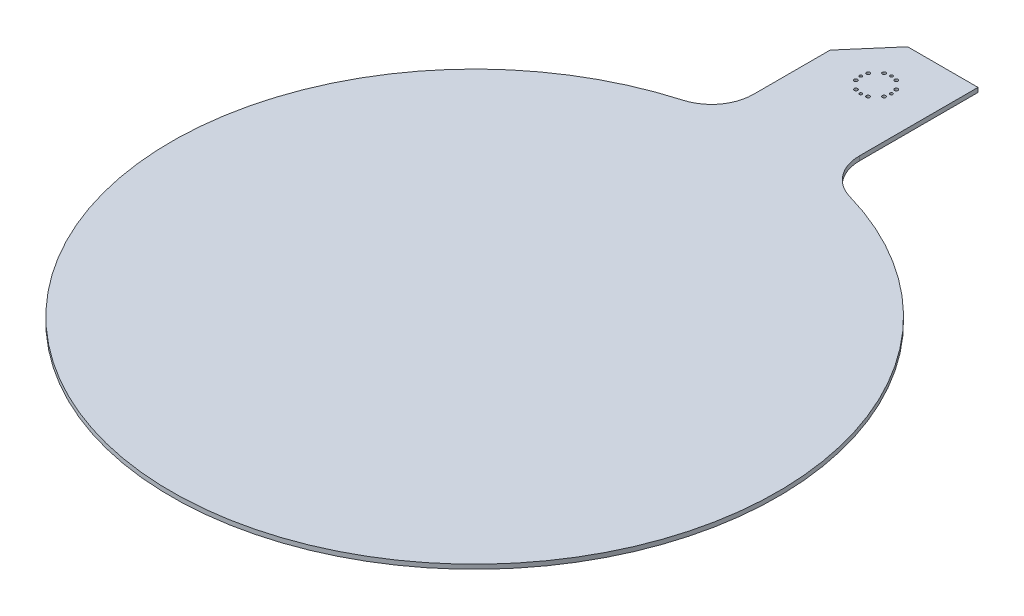
ISO-10303-21;
HEADER;
FILE_DESCRIPTION(('STEP AP214'),'2;1');
FILE_NAME('part.step','',(''),(''),'','','');
FILE_SCHEMA(('AUTOMOTIVE_DESIGN { 1 0 10303 214 1 1 1 1 }'));
ENDSEC;
DATA;
#1=APPLICATION_CONTEXT('core data for automotive mechanical design processes');
#2=APPLICATION_PROTOCOL_DEFINITION('international standard','automotive_design',2000,#1);
#3=PRODUCT_CONTEXT('',#1,'mechanical');
#4=PRODUCT('Part','Part','',(#3));
#5=PRODUCT_RELATED_PRODUCT_CATEGORY('part','',(#4));
#6=PRODUCT_DEFINITION_FORMATION('','',#4);
#7=PRODUCT_DEFINITION_CONTEXT('part definition',#1,'design');
#8=PRODUCT_DEFINITION('design','',#6,#7);
#9=PRODUCT_DEFINITION_SHAPE('','',#8);
#10=(LENGTH_UNIT() NAMED_UNIT(*) SI_UNIT(.MILLI.,.METRE.));
#11=(NAMED_UNIT(*) PLANE_ANGLE_UNIT() SI_UNIT($,.RADIAN.));
#12=(NAMED_UNIT(*) SI_UNIT($,.STERADIAN.) SOLID_ANGLE_UNIT());
#13=UNCERTAINTY_MEASURE_WITH_UNIT(LENGTH_MEASURE(1.E-05),#10,'distance_accuracy_value','');
#14=(GEOMETRIC_REPRESENTATION_CONTEXT(3) GLOBAL_UNCERTAINTY_ASSIGNED_CONTEXT((#13)) GLOBAL_UNIT_ASSIGNED_CONTEXT((#10,
#11,#12)) REPRESENTATION_CONTEXT('',''));
#15=CARTESIAN_POINT('',(0.,0.,0.));
#16=DIRECTION('',(0.,0.,1.));
#17=DIRECTION('',(1.,0.,0.));
#18=AXIS2_PLACEMENT_3D('',#15,#16,#17);
#19=CARTESIAN_POINT('',(-43.2675211566647,3.175,-694.065303124368));
#20=DIRECTION('',(1.,0.,0.));
#21=DIRECTION('',(0.,0.,-1.));
#22=AXIS2_PLACEMENT_3D('',#19,#20,#21);
#23=PLANE('',#22);
#24=DIRECTION('',(0.,0.,1.));
#25=VECTOR('',#24,1.);
#26=CARTESIAN_POINT('',(-43.2675211566647,3.175,-694.065303124368));
#27=LINE('',#26,#25);
#28=CARTESIAN_POINT('',(-43.2675211566647,3.175,-644.143456201817));
#29=VERTEX_POINT('',#28);
#30=CARTESIAN_POINT('',(-43.2675211566647,3.175,-589.112019848932));
#31=VERTEX_POINT('',#30);
#32=EDGE_CURVE('E81',#29,#31,#27,.T.);
#33=ORIENTED_EDGE('',*,*,#32,.F.);
#34=DIRECTION('',(0.,1.,0.));
#35=VECTOR('',#34,1.);
#36=CARTESIAN_POINT('',(-43.2675211566647,0.,-644.143456201817));
#37=LINE('',#36,#35);
#38=CARTESIAN_POINT('',(-43.2675211566647,0.,-644.143456201817));
#39=VERTEX_POINT('',#38);
#40=EDGE_CURVE('E101',#39,#29,#37,.T.);
#41=ORIENTED_EDGE('',*,*,#40,.F.);
#42=DIRECTION('',(0.,0.,1.));
#43=VECTOR('',#42,1.);
#44=CARTESIAN_POINT('',(-43.2675211566647,0.,-694.065303124368));
#45=LINE('',#44,#43);
#46=CARTESIAN_POINT('',(-43.2675211566647,0.,-589.112019848932));
#47=VERTEX_POINT('',#46);
#48=EDGE_CURVE('E109',#39,#47,#45,.T.);
#49=ORIENTED_EDGE('',*,*,#48,.T.);
#50=DIRECTION('',(0.,-1.,0.));
#51=VECTOR('',#50,1.);
#52=CARTESIAN_POINT('',(-43.2675211566647,3.175,-589.112019848932));
#53=LINE('',#52,#51);
#54=EDGE_CURVE('E11',#31,#47,#53,.T.);
#55=ORIENTED_EDGE('',*,*,#54,.F.);
#56=EDGE_LOOP('',(#33,#41,#49,#55));
#57=FACE_BOUND('',#56,.T.);
#58=ADVANCED_FACE('F30',(#57),#23,.F.);
#59=CARTESIAN_POINT('',(-73.2675211566646,3.175,-589.112019848932));
#60=DIRECTION('',(0.,-1.,0.));
#61=DIRECTION('',(0.,0.,-1.));
#62=AXIS2_PLACEMENT_3D('',#59,#60,#61);
#63=CYLINDRICAL_SURFACE('',#62,30.);
#64=CARTESIAN_POINT('',(-73.2675211566646,0.,-589.112019848932));
#65=DIRECTION('',(0.,-1.,0.));
#66=DIRECTION('',(0.,0.,1.));
#67=AXIS2_PLACEMENT_3D('',#64,#65,#66);
#68=CIRCLE('',#67,30.);
#69=CARTESIAN_POINT('',(-65.0129757021191,0.,-560.269993579288));
#70=VERTEX_POINT('',#69);
#71=EDGE_CURVE('E114',#47,#70,#68,.T.);
#72=ORIENTED_EDGE('',*,*,#71,.T.);
#73=DIRECTION('',(0.,-1.,0.));
#74=VECTOR('',#73,1.);
#75=CARTESIAN_POINT('',(-65.0129757021191,3.175,-560.269993579288));
#76=LINE('',#75,#74);
#77=CARTESIAN_POINT('',(-65.0129757021191,3.175,-560.269993579288));
#78=VERTEX_POINT('',#77);
#79=EDGE_CURVE('E37',#78,#70,#76,.T.);
#80=ORIENTED_EDGE('',*,*,#79,.F.);
#81=CARTESIAN_POINT('',(-73.2675211566646,3.175,-589.112019848932));
#82=DIRECTION('',(0.,-1.,0.));
#83=DIRECTION('',(0.,0.,1.));
#84=AXIS2_PLACEMENT_3D('',#81,#82,#83);
#85=CIRCLE('',#84,30.);
#86=EDGE_CURVE('E149',#31,#78,#85,.T.);
#87=ORIENTED_EDGE('',*,*,#86,.F.);
#88=ORIENTED_EDGE('',*,*,#54,.T.);
#89=EDGE_LOOP('',(#72,#80,#87,#88));
#90=FACE_BOUND('',#89,.T.);
#91=ADVANCED_FACE('F243',(#90),#63,.F.);
#92=CARTESIAN_POINT('',(-5.16752115666463,3.175,-351.165303124368));
#93=DIRECTION('',(0.,-1.,0.));
#94=DIRECTION('',(0.,0.,-1.));
#95=AXIS2_PLACEMENT_3D('',#92,#93,#94);
#96=CYLINDRICAL_SURFACE('',#95,217.5);
#97=CARTESIAN_POINT('',(-5.16752115666463,0.,-351.165303124368));
#98=DIRECTION('',(0.,1.,0.));
#99=DIRECTION('',(0.,0.,1.));
#100=AXIS2_PLACEMENT_3D('',#97,#98,#99);
#101=CIRCLE('',#100,217.5);
#102=CARTESIAN_POINT('',(54.6779333887899,0.,-560.269993579288));
#103=VERTEX_POINT('',#102);
#104=EDGE_CURVE('E117',#70,#103,#101,.T.);
#105=ORIENTED_EDGE('',*,*,#104,.T.);
#106=DIRECTION('',(0.,-1.,0.));
#107=VECTOR('',#106,1.);
#108=CARTESIAN_POINT('',(54.6779333887899,3.175,-560.269993579288));
#109=LINE('',#108,#107);
#110=CARTESIAN_POINT('',(54.6779333887899,3.175,-560.269993579288));
#111=VERTEX_POINT('',#110);
#112=EDGE_CURVE('E133',#111,#103,#109,.T.);
#113=ORIENTED_EDGE('',*,*,#112,.F.);
#114=CARTESIAN_POINT('',(-5.16752115666463,3.175,-351.165303124368));
#115=DIRECTION('',(0.,1.,0.));
#116=DIRECTION('',(0.,0.,1.));
#117=AXIS2_PLACEMENT_3D('',#114,#115,#116);
#118=CIRCLE('',#117,217.5);
#119=EDGE_CURVE('E140',#78,#111,#118,.T.);
#120=ORIENTED_EDGE('',*,*,#119,.F.);
#121=ORIENTED_EDGE('',*,*,#79,.T.);
#122=EDGE_LOOP('',(#105,#113,#120,#121));
#123=FACE_BOUND('',#122,.T.);
#124=ADVANCED_FACE('F138',(#123),#96,.T.);
#125=CARTESIAN_POINT('',(62.9324788433353,3.175,-589.112019848932));
#126=DIRECTION('',(0.,-1.,0.));
#127=DIRECTION('',(0.,0.,-1.));
#128=AXIS2_PLACEMENT_3D('',#125,#126,#127);
#129=CYLINDRICAL_SURFACE('',#128,29.9999999999999);
#130=CARTESIAN_POINT('',(62.9324788433353,0.,-589.112019848932));
#131=DIRECTION('',(0.,-1.,0.));
#132=DIRECTION('',(0.,0.,1.));
#133=AXIS2_PLACEMENT_3D('',#130,#131,#132);
#134=CIRCLE('',#133,29.9999999999999);
#135=CARTESIAN_POINT('',(32.9324788433354,0.,-589.112019848932));
#136=VERTEX_POINT('',#135);
#137=EDGE_CURVE('E74',#103,#136,#134,.T.);
#138=ORIENTED_EDGE('',*,*,#137,.T.);
#139=DIRECTION('',(0.,-1.,0.));
#140=VECTOR('',#139,1.);
#141=CARTESIAN_POINT('',(32.9324788433354,3.175,-589.112019848932));
#142=LINE('',#141,#140);
#143=CARTESIAN_POINT('',(32.9324788433354,3.175,-589.112019848932));
#144=VERTEX_POINT('',#143);
#145=EDGE_CURVE('E131',#144,#136,#142,.T.);
#146=ORIENTED_EDGE('',*,*,#145,.F.);
#147=CARTESIAN_POINT('',(62.9324788433353,3.175,-589.112019848932));
#148=DIRECTION('',(0.,-1.,0.));
#149=DIRECTION('',(0.,0.,1.));
#150=AXIS2_PLACEMENT_3D('',#147,#148,#149);
#151=CIRCLE('',#150,29.9999999999999);
#152=EDGE_CURVE('E53',#111,#144,#151,.T.);
#153=ORIENTED_EDGE('',*,*,#152,.F.);
#154=ORIENTED_EDGE('',*,*,#112,.T.);
#155=EDGE_LOOP('',(#138,#146,#153,#154));
#156=FACE_BOUND('',#155,.T.);
#157=ADVANCED_FACE('F148',(#156),#129,.F.);
#158=CARTESIAN_POINT('',(32.9324788433353,3.175,-694.065303124368));
#159=DIRECTION('',(-1.,0.,0.));
#160=DIRECTION('',(0.,0.,1.));
#161=AXIS2_PLACEMENT_3D('',#158,#159,#160);
#162=PLANE('',#161);
#163=DIRECTION('',(0.,0.,-1.));
#164=VECTOR('',#163,1.);
#165=CARTESIAN_POINT('',(32.9324788433353,0.,-694.065303124368));
#166=LINE('',#165,#164);
#167=CARTESIAN_POINT('',(32.9324788433353,0.,-674.065303124368));
#168=VERTEX_POINT('',#167);
#169=EDGE_CURVE('E128',#136,#168,#166,.T.);
#170=ORIENTED_EDGE('',*,*,#169,.T.);
#171=DIRECTION('',(0.,1.,0.));
#172=VECTOR('',#171,1.);
#173=CARTESIAN_POINT('',(32.9324788433353,0.,-674.065303124368));
#174=LINE('',#173,#172);
#175=CARTESIAN_POINT('',(32.9324788433353,3.175,-674.065303124368));
#176=VERTEX_POINT('',#175);
#177=EDGE_CURVE('E147',#168,#176,#174,.T.);
#178=ORIENTED_EDGE('',*,*,#177,.T.);
#179=DIRECTION('',(0.,0.,-1.));
#180=VECTOR('',#179,1.);
#181=CARTESIAN_POINT('',(32.9324788433353,3.175,-694.065303124368));
#182=LINE('',#181,#180);
#183=EDGE_CURVE('E123',#144,#176,#182,.T.);
#184=ORIENTED_EDGE('',*,*,#183,.F.);
#185=ORIENTED_EDGE('',*,*,#145,.T.);
#186=EDGE_LOOP('',(#170,#178,#184,#185));
#187=FACE_BOUND('',#186,.T.);
#188=ADVANCED_FACE('F145',(#187),#162,.F.);
#189=CARTESIAN_POINT('',(-73.2675211566646,3.175,-589.112019848932));
#190=DIRECTION('',(0.,1.,0.));
#191=DIRECTION('',(0.,0.,1.));
#192=AXIS2_PLACEMENT_3D('',#189,#190,#191);
#193=PLANE('',#192);
#194=DIRECTION('',(1.,0.,0.));
#195=VECTOR('',#194,1.);
#196=CARTESIAN_POINT('',(32.9324788433353,3.175,-674.065303124368));
#197=LINE('',#196,#195);
#198=CARTESIAN_POINT('',(-17.5158963327746,3.175,-674.065303124368));
#199=VERTEX_POINT('',#198);
#200=EDGE_CURVE('E105',#199,#176,#197,.T.);
#201=ORIENTED_EDGE('',*,*,#200,.F.);
#202=DIRECTION('',(0.652313511040861,0.,-0.757949261701299));
#203=VECTOR('',#202,1.);
#204=CARTESIAN_POINT('',(-17.5158963327746,3.175,-674.065303124368));
#205=LINE('',#204,#203);
#206=EDGE_CURVE('E225',#29,#199,#205,.T.);
#207=ORIENTED_EDGE('',*,*,#206,.F.);
#208=ORIENTED_EDGE('',*,*,#32,.T.);
#209=ORIENTED_EDGE('',*,*,#86,.T.);
#210=ORIENTED_EDGE('',*,*,#119,.T.);
#211=ORIENTED_EDGE('',*,*,#152,.T.);
#212=ORIENTED_EDGE('',*,*,#183,.T.);
#213=EDGE_LOOP('',(#201,#207,#208,#209,#210,#211,#212));
#214=FACE_BOUND('',#213,.T.);
#215=CARTESIAN_POINT('',(4.92205094142839,3.175,-643.447144618236));
#216=DIRECTION('',(0.,1.,0.));
#217=DIRECTION('',(0.,0.,1.));
#218=AXIS2_PLACEMENT_3D('',#215,#216,#217);
#219=CIRCLE('',#218,1.24999999999984);
#220=CARTESIAN_POINT('',(4.92205094142839,3.175,-642.197144618236));
#221=VERTEX_POINT('',#220);
#222=EDGE_CURVE('E217',#221,#221,#219,.T.);
#223=ORIENTED_EDGE('',*,*,#222,.F.);
#224=EDGE_LOOP('',(#223));
#225=FACE_BOUND('',#224,.T.);
#226=CARTESIAN_POINT('',(4.92205094142828,3.175,-634.6834616305));
#227=DIRECTION('',(0.,1.,0.));
#228=DIRECTION('',(0.,0.,1.));
#229=AXIS2_PLACEMENT_3D('',#226,#227,#228);
#230=CIRCLE('',#229,1.24999999999984);
#231=CARTESIAN_POINT('',(4.92205094142828,3.175,-633.4334616305));
#232=VERTEX_POINT('',#231);
#233=EDGE_CURVE('E211',#232,#232,#230,.T.);
#234=ORIENTED_EDGE('',*,*,#233,.F.);
#235=EDGE_LOOP('',(#234));
#236=FACE_BOUND('',#235,.T.);
#237=CARTESIAN_POINT('',(5.83247884333549,3.175,-639.065303124368));
#238=DIRECTION('',(0.,1.,0.));
#239=DIRECTION('',(0.,0.,1.));
#240=AXIS2_PLACEMENT_3D('',#237,#238,#239);
#241=CIRCLE('',#240,1.00000000000005);
#242=CARTESIAN_POINT('',(5.83247884333549,3.175,-638.065303124368));
#243=VERTEX_POINT('',#242);
#244=EDGE_CURVE('E205',#243,#243,#241,.T.);
#245=ORIENTED_EDGE('',*,*,#244,.F.);
#246=EDGE_LOOP('',(#245));
#247=FACE_BOUND('',#246,.T.);
#248=CARTESIAN_POINT('',(-9.54936265053265,3.175,-649.154875222461));
#249=DIRECTION('',(0.,1.,0.));
#250=DIRECTION('',(0.,0.,1.));
#251=AXIS2_PLACEMENT_3D('',#248,#249,#250);
#252=CIRCLE('',#251,1.24999999999991);
#253=CARTESIAN_POINT('',(-9.54936265053265,3.175,-647.904875222461));
#254=VERTEX_POINT('',#253);
#255=EDGE_CURVE('E199',#254,#254,#252,.T.);
#256=ORIENTED_EDGE('',*,*,#255,.F.);
#257=EDGE_LOOP('',(#256));
#258=FACE_BOUND('',#257,.T.);
#259=CARTESIAN_POINT('',(-0.785679662796523,3.175,-649.154875222461));
#260=DIRECTION('',(0.,1.,0.));
#261=DIRECTION('',(0.,0.,1.));
#262=AXIS2_PLACEMENT_3D('',#259,#260,#261);
#263=CIRCLE('',#262,1.24999999999992);
#264=CARTESIAN_POINT('',(-0.785679662796523,3.175,-647.904875222461));
#265=VERTEX_POINT('',#264);
#266=EDGE_CURVE('E193',#265,#265,#263,.T.);
#267=ORIENTED_EDGE('',*,*,#266,.F.);
#268=EDGE_LOOP('',(#267));
#269=FACE_BOUND('',#268,.T.);
#270=CARTESIAN_POINT('',(-5.16752115666458,3.175,-650.065303124368));
#271=DIRECTION('',(0.,1.,0.));
#272=DIRECTION('',(0.,0.,1.));
#273=AXIS2_PLACEMENT_3D('',#270,#271,#272);
#274=CIRCLE('',#273,1.);
#275=CARTESIAN_POINT('',(-5.16752115666458,3.175,-649.065303124368));
#276=VERTEX_POINT('',#275);
#277=EDGE_CURVE('E187',#276,#276,#274,.T.);
#278=ORIENTED_EDGE('',*,*,#277,.F.);
#279=EDGE_LOOP('',(#278));
#280=FACE_BOUND('',#279,.T.);
#281=CARTESIAN_POINT('',(-15.2570932547575,3.175,-634.6834616305));
#282=DIRECTION('',(0.,1.,0.));
#283=DIRECTION('',(0.,0.,1.));
#284=AXIS2_PLACEMENT_3D('',#281,#282,#283);
#285=CIRCLE('',#284,1.24999999999994);
#286=CARTESIAN_POINT('',(-15.2570932547575,3.175,-633.4334616305));
#287=VERTEX_POINT('',#286);
#288=EDGE_CURVE('E181',#287,#287,#285,.T.);
#289=ORIENTED_EDGE('',*,*,#288,.F.);
#290=EDGE_LOOP('',(#289));
#291=FACE_BOUND('',#290,.T.);
#292=CARTESIAN_POINT('',(-15.2570932547575,3.175,-643.447144618236));
#293=DIRECTION('',(0.,1.,0.));
#294=DIRECTION('',(0.,0.,1.));
#295=AXIS2_PLACEMENT_3D('',#292,#293,#294);
#296=CIRCLE('',#295,1.24999999999994);
#297=CARTESIAN_POINT('',(-15.2570932547575,3.175,-642.197144618236));
#298=VERTEX_POINT('',#297);
#299=EDGE_CURVE('E175',#298,#298,#296,.T.);
#300=ORIENTED_EDGE('',*,*,#299,.F.);
#301=EDGE_LOOP('',(#300));
#302=FACE_BOUND('',#301,.T.);
#303=CARTESIAN_POINT('',(-0.785679662796589,3.175,-628.975731026275));
#304=DIRECTION('',(0.,1.,0.));
#305=DIRECTION('',(0.,0.,1.));
#306=AXIS2_PLACEMENT_3D('',#303,#304,#305);
#307=CIRCLE('',#306,1.24999999999991);
#308=CARTESIAN_POINT('',(-0.785679662796589,3.175,-627.725731026275));
#309=VERTEX_POINT('',#308);
#310=EDGE_CURVE('E169',#309,#309,#307,.T.);
#311=ORIENTED_EDGE('',*,*,#310,.F.);
#312=EDGE_LOOP('',(#311));
#313=FACE_BOUND('',#312,.T.);
#314=CARTESIAN_POINT('',(-9.54936265053271,3.175,-628.975731026275));
#315=DIRECTION('',(0.,1.,0.));
#316=DIRECTION('',(0.,0.,1.));
#317=AXIS2_PLACEMENT_3D('',#314,#315,#316);
#318=CIRCLE('',#317,1.24999999999991);
#319=CARTESIAN_POINT('',(-9.54936265053271,3.175,-627.725731026275));
#320=VERTEX_POINT('',#319);
#321=EDGE_CURVE('E163',#320,#320,#318,.T.);
#322=ORIENTED_EDGE('',*,*,#321,.F.);
#323=EDGE_LOOP('',(#322));
#324=FACE_BOUND('',#323,.T.);
#325=CARTESIAN_POINT('',(-5.16752115666465,3.175,-628.065303124368));
#326=DIRECTION('',(0.,1.,0.));
#327=DIRECTION('',(0.,0.,1.));
#328=AXIS2_PLACEMENT_3D('',#325,#326,#327);
#329=CIRCLE('',#328,1.);
#330=CARTESIAN_POINT('',(-5.16752115666465,3.175,-627.065303124368));
#331=VERTEX_POINT('',#330);
#332=EDGE_CURVE('E157',#331,#331,#329,.T.);
#333=ORIENTED_EDGE('',*,*,#332,.F.);
#334=EDGE_LOOP('',(#333));
#335=FACE_BOUND('',#334,.T.);
#336=CARTESIAN_POINT('',(-16.1675211566646,3.175,-639.065303124368));
#337=DIRECTION('',(0.,1.,0.));
#338=DIRECTION('',(0.,0.,1.));
#339=AXIS2_PLACEMENT_3D('',#336,#337,#338);
#340=CIRCLE('',#339,0.999999999999945);
#341=CARTESIAN_POINT('',(-16.1675211566646,3.175,-638.065303124368));
#342=VERTEX_POINT('',#341);
#343=EDGE_CURVE('E120',#342,#342,#340,.T.);
#344=ORIENTED_EDGE('',*,*,#343,.F.);
#345=EDGE_LOOP('',(#344));
#346=FACE_BOUND('',#345,.T.);
#347=ADVANCED_FACE('F228',(#214,#225,#236,#247,#258,#269,#280,#291,#302,#313,#324,#335,#346),
#193,.T.);
#348=CARTESIAN_POINT('',(-73.2675211566646,0.,-589.112019848932));
#349=DIRECTION('',(0.,1.,0.));
#350=DIRECTION('',(0.,0.,1.));
#351=AXIS2_PLACEMENT_3D('',#348,#349,#350);
#352=PLANE('',#351);
#353=CARTESIAN_POINT('',(4.92205094142839,0.,-643.447144618236));
#354=DIRECTION('',(0.,1.,0.));
#355=DIRECTION('',(0.,0.,1.));
#356=AXIS2_PLACEMENT_3D('',#353,#354,#355);
#357=CIRCLE('',#356,1.24999999999984);
#358=CARTESIAN_POINT('',(4.92205094142839,0.,-642.197144618236));
#359=VERTEX_POINT('',#358);
#360=EDGE_CURVE('E214',#359,#359,#357,.T.);
#361=ORIENTED_EDGE('',*,*,#360,.T.);
#362=EDGE_LOOP('',(#361));
#363=FACE_BOUND('',#362,.T.);
#364=CARTESIAN_POINT('',(4.92205094142828,0.,-634.6834616305));
#365=DIRECTION('',(0.,1.,0.));
#366=DIRECTION('',(0.,0.,1.));
#367=AXIS2_PLACEMENT_3D('',#364,#365,#366);
#368=CIRCLE('',#367,1.24999999999984);
#369=CARTESIAN_POINT('',(4.92205094142828,0.,-633.4334616305));
#370=VERTEX_POINT('',#369);
#371=EDGE_CURVE('E208',#370,#370,#368,.T.);
#372=ORIENTED_EDGE('',*,*,#371,.T.);
#373=EDGE_LOOP('',(#372));
#374=FACE_BOUND('',#373,.T.);
#375=CARTESIAN_POINT('',(5.83247884333549,0.,-639.065303124368));
#376=DIRECTION('',(0.,1.,0.));
#377=DIRECTION('',(0.,0.,1.));
#378=AXIS2_PLACEMENT_3D('',#375,#376,#377);
#379=CIRCLE('',#378,1.00000000000005);
#380=CARTESIAN_POINT('',(5.83247884333549,0.,-638.065303124368));
#381=VERTEX_POINT('',#380);
#382=EDGE_CURVE('E202',#381,#381,#379,.T.);
#383=ORIENTED_EDGE('',*,*,#382,.T.);
#384=EDGE_LOOP('',(#383));
#385=FACE_BOUND('',#384,.T.);
#386=CARTESIAN_POINT('',(-9.54936265053265,0.,-649.154875222461));
#387=DIRECTION('',(0.,1.,0.));
#388=DIRECTION('',(0.,0.,1.));
#389=AXIS2_PLACEMENT_3D('',#386,#387,#388);
#390=CIRCLE('',#389,1.24999999999991);
#391=CARTESIAN_POINT('',(-9.54936265053265,0.,-647.904875222461));
#392=VERTEX_POINT('',#391);
#393=EDGE_CURVE('E196',#392,#392,#390,.T.);
#394=ORIENTED_EDGE('',*,*,#393,.T.);
#395=EDGE_LOOP('',(#394));
#396=FACE_BOUND('',#395,.T.);
#397=CARTESIAN_POINT('',(-0.785679662796523,0.,-649.154875222461));
#398=DIRECTION('',(0.,1.,0.));
#399=DIRECTION('',(0.,0.,1.));
#400=AXIS2_PLACEMENT_3D('',#397,#398,#399);
#401=CIRCLE('',#400,1.24999999999992);
#402=CARTESIAN_POINT('',(-0.785679662796523,0.,-647.904875222461));
#403=VERTEX_POINT('',#402);
#404=EDGE_CURVE('E190',#403,#403,#401,.T.);
#405=ORIENTED_EDGE('',*,*,#404,.T.);
#406=EDGE_LOOP('',(#405));
#407=FACE_BOUND('',#406,.T.);
#408=CARTESIAN_POINT('',(-5.16752115666458,0.,-650.065303124368));
#409=DIRECTION('',(0.,1.,0.));
#410=DIRECTION('',(0.,0.,1.));
#411=AXIS2_PLACEMENT_3D('',#408,#409,#410);
#412=CIRCLE('',#411,1.);
#413=CARTESIAN_POINT('',(-5.16752115666458,0.,-649.065303124368));
#414=VERTEX_POINT('',#413);
#415=EDGE_CURVE('E184',#414,#414,#412,.T.);
#416=ORIENTED_EDGE('',*,*,#415,.T.);
#417=EDGE_LOOP('',(#416));
#418=FACE_BOUND('',#417,.T.);
#419=CARTESIAN_POINT('',(-15.2570932547575,0.,-634.6834616305));
#420=DIRECTION('',(0.,1.,0.));
#421=DIRECTION('',(0.,0.,1.));
#422=AXIS2_PLACEMENT_3D('',#419,#420,#421);
#423=CIRCLE('',#422,1.24999999999994);
#424=CARTESIAN_POINT('',(-15.2570932547575,0.,-633.4334616305));
#425=VERTEX_POINT('',#424);
#426=EDGE_CURVE('E178',#425,#425,#423,.T.);
#427=ORIENTED_EDGE('',*,*,#426,.T.);
#428=EDGE_LOOP('',(#427));
#429=FACE_BOUND('',#428,.T.);
#430=CARTESIAN_POINT('',(-15.2570932547575,0.,-643.447144618236));
#431=DIRECTION('',(0.,1.,0.));
#432=DIRECTION('',(0.,0.,1.));
#433=AXIS2_PLACEMENT_3D('',#430,#431,#432);
#434=CIRCLE('',#433,1.24999999999994);
#435=CARTESIAN_POINT('',(-15.2570932547575,0.,-642.197144618236));
#436=VERTEX_POINT('',#435);
#437=EDGE_CURVE('E172',#436,#436,#434,.T.);
#438=ORIENTED_EDGE('',*,*,#437,.T.);
#439=EDGE_LOOP('',(#438));
#440=FACE_BOUND('',#439,.T.);
#441=CARTESIAN_POINT('',(-0.785679662796589,0.,-628.975731026275));
#442=DIRECTION('',(0.,1.,0.));
#443=DIRECTION('',(0.,0.,1.));
#444=AXIS2_PLACEMENT_3D('',#441,#442,#443);
#445=CIRCLE('',#444,1.24999999999991);
#446=CARTESIAN_POINT('',(-0.785679662796589,0.,-627.725731026275));
#447=VERTEX_POINT('',#446);
#448=EDGE_CURVE('E166',#447,#447,#445,.T.);
#449=ORIENTED_EDGE('',*,*,#448,.T.);
#450=EDGE_LOOP('',(#449));
#451=FACE_BOUND('',#450,.T.);
#452=CARTESIAN_POINT('',(-9.54936265053271,0.,-628.975731026275));
#453=DIRECTION('',(0.,1.,0.));
#454=DIRECTION('',(0.,0.,1.));
#455=AXIS2_PLACEMENT_3D('',#452,#453,#454);
#456=CIRCLE('',#455,1.24999999999991);
#457=CARTESIAN_POINT('',(-9.54936265053271,0.,-627.725731026275));
#458=VERTEX_POINT('',#457);
#459=EDGE_CURVE('E160',#458,#458,#456,.T.);
#460=ORIENTED_EDGE('',*,*,#459,.T.);
#461=EDGE_LOOP('',(#460));
#462=FACE_BOUND('',#461,.T.);
#463=CARTESIAN_POINT('',(-5.16752115666465,0.,-628.065303124368));
#464=DIRECTION('',(0.,1.,0.));
#465=DIRECTION('',(0.,0.,1.));
#466=AXIS2_PLACEMENT_3D('',#463,#464,#465);
#467=CIRCLE('',#466,1.);
#468=CARTESIAN_POINT('',(-5.16752115666465,0.,-627.065303124368));
#469=VERTEX_POINT('',#468);
#470=EDGE_CURVE('E155',#469,#469,#467,.T.);
#471=ORIENTED_EDGE('',*,*,#470,.T.);
#472=EDGE_LOOP('',(#471));
#473=FACE_BOUND('',#472,.T.);
#474=CARTESIAN_POINT('',(-16.1675211566646,0.,-639.065303124368));
#475=DIRECTION('',(0.,1.,0.));
#476=DIRECTION('',(0.,0.,1.));
#477=AXIS2_PLACEMENT_3D('',#474,#475,#476);
#478=CIRCLE('',#477,0.999999999999945);
#479=CARTESIAN_POINT('',(-16.1675211566646,0.,-638.065303124368));
#480=VERTEX_POINT('',#479);
#481=EDGE_CURVE('E115',#480,#480,#478,.T.);
#482=ORIENTED_EDGE('',*,*,#481,.T.);
#483=EDGE_LOOP('',(#482));
#484=FACE_BOUND('',#483,.T.);
#485=DIRECTION('',(0.652313511040861,0.,-0.757949261701299));
#486=VECTOR('',#485,1.);
#487=CARTESIAN_POINT('',(-17.5158963327746,0.,-674.065303124368));
#488=LINE('',#487,#486);
#489=CARTESIAN_POINT('',(-17.5158963327745,0.,-674.065303124368));
#490=VERTEX_POINT('',#489);
#491=EDGE_CURVE('E97',#39,#490,#488,.T.);
#492=ORIENTED_EDGE('',*,*,#491,.T.);
#493=DIRECTION('',(1.,0.,0.));
#494=VECTOR('',#493,1.);
#495=CARTESIAN_POINT('',(32.9324788433353,0.,-674.065303124368));
#496=LINE('',#495,#494);
#497=EDGE_CURVE('E44',#490,#168,#496,.T.);
#498=ORIENTED_EDGE('',*,*,#497,.T.);
#499=ORIENTED_EDGE('',*,*,#169,.F.);
#500=ORIENTED_EDGE('',*,*,#137,.F.);
#501=ORIENTED_EDGE('',*,*,#104,.F.);
#502=ORIENTED_EDGE('',*,*,#71,.F.);
#503=ORIENTED_EDGE('',*,*,#48,.F.);
#504=EDGE_LOOP('',(#492,#498,#499,#500,#501,#502,#503));
#505=FACE_BOUND('',#504,.T.);
#506=ADVANCED_FACE('F112',(#363,#374,#385,#396,#407,#418,#429,#440,#451,#462,#473,#484,#505),
#352,.F.);
#507=CARTESIAN_POINT('',(-16.1675211566646,0.,-639.065303124368));
#508=DIRECTION('',(0.,1.,0.));
#509=DIRECTION('',(0.,0.,1.));
#510=AXIS2_PLACEMENT_3D('',#507,#508,#509);
#511=CYLINDRICAL_SURFACE('',#510,0.999999999999945);
#512=ORIENTED_EDGE('',*,*,#481,.F.);
#513=EDGE_LOOP('',(#512));
#514=FACE_BOUND('',#513,.T.);
#515=ORIENTED_EDGE('',*,*,#343,.T.);
#516=EDGE_LOOP('',(#515));
#517=FACE_BOUND('',#516,.T.);
#518=ADVANCED_FACE('F258',(#514,#517),#511,.F.);
#519=CARTESIAN_POINT('',(-5.16752115666465,0.,-628.065303124368));
#520=DIRECTION('',(0.,1.,0.));
#521=DIRECTION('',(0.,0.,1.));
#522=AXIS2_PLACEMENT_3D('',#519,#520,#521);
#523=CYLINDRICAL_SURFACE('',#522,1.);
#524=ORIENTED_EDGE('',*,*,#470,.F.);
#525=EDGE_LOOP('',(#524));
#526=FACE_BOUND('',#525,.T.);
#527=ORIENTED_EDGE('',*,*,#332,.T.);
#528=EDGE_LOOP('',(#527));
#529=FACE_BOUND('',#528,.T.);
#530=ADVANCED_FACE('F264',(#526,#529),#523,.F.);
#531=CARTESIAN_POINT('',(-9.54936265053271,0.,-628.975731026275));
#532=DIRECTION('',(0.,1.,0.));
#533=DIRECTION('',(0.,0.,1.));
#534=AXIS2_PLACEMENT_3D('',#531,#532,#533);
#535=CYLINDRICAL_SURFACE('',#534,1.24999999999991);
#536=ORIENTED_EDGE('',*,*,#459,.F.);
#537=EDGE_LOOP('',(#536));
#538=FACE_BOUND('',#537,.T.);
#539=ORIENTED_EDGE('',*,*,#321,.T.);
#540=EDGE_LOOP('',(#539));
#541=FACE_BOUND('',#540,.T.);
#542=ADVANCED_FACE('F268',(#538,#541),#535,.F.);
#543=CARTESIAN_POINT('',(-0.785679662796589,0.,-628.975731026275));
#544=DIRECTION('',(0.,1.,0.));
#545=DIRECTION('',(0.,0.,1.));
#546=AXIS2_PLACEMENT_3D('',#543,#544,#545);
#547=CYLINDRICAL_SURFACE('',#546,1.24999999999991);
#548=ORIENTED_EDGE('',*,*,#448,.F.);
#549=EDGE_LOOP('',(#548));
#550=FACE_BOUND('',#549,.T.);
#551=ORIENTED_EDGE('',*,*,#310,.T.);
#552=EDGE_LOOP('',(#551));
#553=FACE_BOUND('',#552,.T.);
#554=ADVANCED_FACE('F272',(#550,#553),#547,.F.);
#555=CARTESIAN_POINT('',(-15.2570932547575,0.,-643.447144618236));
#556=DIRECTION('',(0.,1.,0.));
#557=DIRECTION('',(0.,0.,1.));
#558=AXIS2_PLACEMENT_3D('',#555,#556,#557);
#559=CYLINDRICAL_SURFACE('',#558,1.24999999999994);
#560=ORIENTED_EDGE('',*,*,#437,.F.);
#561=EDGE_LOOP('',(#560));
#562=FACE_BOUND('',#561,.T.);
#563=ORIENTED_EDGE('',*,*,#299,.T.);
#564=EDGE_LOOP('',(#563));
#565=FACE_BOUND('',#564,.T.);
#566=ADVANCED_FACE('F276',(#562,#565),#559,.F.);
#567=CARTESIAN_POINT('',(-15.2570932547575,0.,-634.6834616305));
#568=DIRECTION('',(0.,1.,0.));
#569=DIRECTION('',(0.,0.,1.));
#570=AXIS2_PLACEMENT_3D('',#567,#568,#569);
#571=CYLINDRICAL_SURFACE('',#570,1.24999999999994);
#572=ORIENTED_EDGE('',*,*,#426,.F.);
#573=EDGE_LOOP('',(#572));
#574=FACE_BOUND('',#573,.T.);
#575=ORIENTED_EDGE('',*,*,#288,.T.);
#576=EDGE_LOOP('',(#575));
#577=FACE_BOUND('',#576,.T.);
#578=ADVANCED_FACE('F280',(#574,#577),#571,.F.);
#579=CARTESIAN_POINT('',(-5.16752115666458,0.,-650.065303124368));
#580=DIRECTION('',(0.,1.,0.));
#581=DIRECTION('',(0.,0.,1.));
#582=AXIS2_PLACEMENT_3D('',#579,#580,#581);
#583=CYLINDRICAL_SURFACE('',#582,1.);
#584=ORIENTED_EDGE('',*,*,#415,.F.);
#585=EDGE_LOOP('',(#584));
#586=FACE_BOUND('',#585,.T.);
#587=ORIENTED_EDGE('',*,*,#277,.T.);
#588=EDGE_LOOP('',(#587));
#589=FACE_BOUND('',#588,.T.);
#590=ADVANCED_FACE('F284',(#586,#589),#583,.F.);
#591=CARTESIAN_POINT('',(-0.785679662796523,0.,-649.154875222461));
#592=DIRECTION('',(0.,1.,0.));
#593=DIRECTION('',(0.,0.,1.));
#594=AXIS2_PLACEMENT_3D('',#591,#592,#593);
#595=CYLINDRICAL_SURFACE('',#594,1.24999999999992);
#596=ORIENTED_EDGE('',*,*,#404,.F.);
#597=EDGE_LOOP('',(#596));
#598=FACE_BOUND('',#597,.T.);
#599=ORIENTED_EDGE('',*,*,#266,.T.);
#600=EDGE_LOOP('',(#599));
#601=FACE_BOUND('',#600,.T.);
#602=ADVANCED_FACE('F288',(#598,#601),#595,.F.);
#603=CARTESIAN_POINT('',(-9.54936265053265,0.,-649.154875222461));
#604=DIRECTION('',(0.,1.,0.));
#605=DIRECTION('',(0.,0.,1.));
#606=AXIS2_PLACEMENT_3D('',#603,#604,#605);
#607=CYLINDRICAL_SURFACE('',#606,1.24999999999991);
#608=ORIENTED_EDGE('',*,*,#393,.F.);
#609=EDGE_LOOP('',(#608));
#610=FACE_BOUND('',#609,.T.);
#611=ORIENTED_EDGE('',*,*,#255,.T.);
#612=EDGE_LOOP('',(#611));
#613=FACE_BOUND('',#612,.T.);
#614=ADVANCED_FACE('F292',(#610,#613),#607,.F.);
#615=CARTESIAN_POINT('',(5.83247884333549,0.,-639.065303124368));
#616=DIRECTION('',(0.,1.,0.));
#617=DIRECTION('',(0.,0.,1.));
#618=AXIS2_PLACEMENT_3D('',#615,#616,#617);
#619=CYLINDRICAL_SURFACE('',#618,1.00000000000005);
#620=ORIENTED_EDGE('',*,*,#382,.F.);
#621=EDGE_LOOP('',(#620));
#622=FACE_BOUND('',#621,.T.);
#623=ORIENTED_EDGE('',*,*,#244,.T.);
#624=EDGE_LOOP('',(#623));
#625=FACE_BOUND('',#624,.T.);
#626=ADVANCED_FACE('F296',(#622,#625),#619,.F.);
#627=CARTESIAN_POINT('',(4.92205094142828,0.,-634.6834616305));
#628=DIRECTION('',(0.,1.,0.));
#629=DIRECTION('',(0.,0.,1.));
#630=AXIS2_PLACEMENT_3D('',#627,#628,#629);
#631=CYLINDRICAL_SURFACE('',#630,1.24999999999984);
#632=ORIENTED_EDGE('',*,*,#371,.F.);
#633=EDGE_LOOP('',(#632));
#634=FACE_BOUND('',#633,.T.);
#635=ORIENTED_EDGE('',*,*,#233,.T.);
#636=EDGE_LOOP('',(#635));
#637=FACE_BOUND('',#636,.T.);
#638=ADVANCED_FACE('F239',(#634,#637),#631,.F.);
#639=CARTESIAN_POINT('',(4.92205094142839,0.,-643.447144618236));
#640=DIRECTION('',(0.,1.,0.));
#641=DIRECTION('',(0.,0.,1.));
#642=AXIS2_PLACEMENT_3D('',#639,#640,#641);
#643=CYLINDRICAL_SURFACE('',#642,1.24999999999984);
#644=ORIENTED_EDGE('',*,*,#360,.F.);
#645=EDGE_LOOP('',(#644));
#646=FACE_BOUND('',#645,.T.);
#647=ORIENTED_EDGE('',*,*,#222,.T.);
#648=EDGE_LOOP('',(#647));
#649=FACE_BOUND('',#648,.T.);
#650=ADVANCED_FACE('F232',(#646,#649),#643,.F.);
#651=CARTESIAN_POINT('',(32.9324788433353,0.,-674.065303124368));
#652=DIRECTION('',(0.,0.,1.));
#653=DIRECTION('',(1.,0.,0.));
#654=AXIS2_PLACEMENT_3D('',#651,#652,#653);
#655=PLANE('',#654);
#656=ORIENTED_EDGE('',*,*,#200,.T.);
#657=ORIENTED_EDGE('',*,*,#177,.F.);
#658=ORIENTED_EDGE('',*,*,#497,.F.);
#659=DIRECTION('',(0.,1.,0.));
#660=VECTOR('',#659,1.);
#661=CARTESIAN_POINT('',(-17.5158963327746,0.,-674.065303124368));
#662=LINE('',#661,#660);
#663=EDGE_CURVE('E102',#490,#199,#662,.T.);
#664=ORIENTED_EDGE('',*,*,#663,.T.);
#665=EDGE_LOOP('',(#656,#657,#658,#664));
#666=FACE_BOUND('',#665,.T.);
#667=ADVANCED_FACE('F230',(#666),#655,.F.);
#668=CARTESIAN_POINT('',(-17.5158963327746,0.,-674.065303124368));
#669=DIRECTION('',(0.757949261701299,0.,0.652313511040861));
#670=DIRECTION('',(0.652313511040861,0.,-0.757949261701299));
#671=AXIS2_PLACEMENT_3D('',#668,#669,#670);
#672=PLANE('',#671);
#673=ORIENTED_EDGE('',*,*,#206,.T.);
#674=ORIENTED_EDGE('',*,*,#663,.F.);
#675=ORIENTED_EDGE('',*,*,#491,.F.);
#676=ORIENTED_EDGE('',*,*,#40,.T.);
#677=EDGE_LOOP('',(#673,#674,#675,#676));
#678=FACE_BOUND('',#677,.T.);
#679=ADVANCED_FACE('F100',(#678),#672,.F.);
#680=CLOSED_SHELL('',(#58,#91,#124,#157,#188,#347,#506,#518,#530,#542,#554,#566,#578,#590,#602,
#614,#626,#638,#650,#667,#679));
#681=MANIFOLD_SOLID_BREP('B2',#680);
#682=ADVANCED_BREP_SHAPE_REPRESENTATION('',(#18,#681),#14);
#683=SHAPE_DEFINITION_REPRESENTATION(#9,#682);
ENDSEC;
END-ISO-10303-21;
